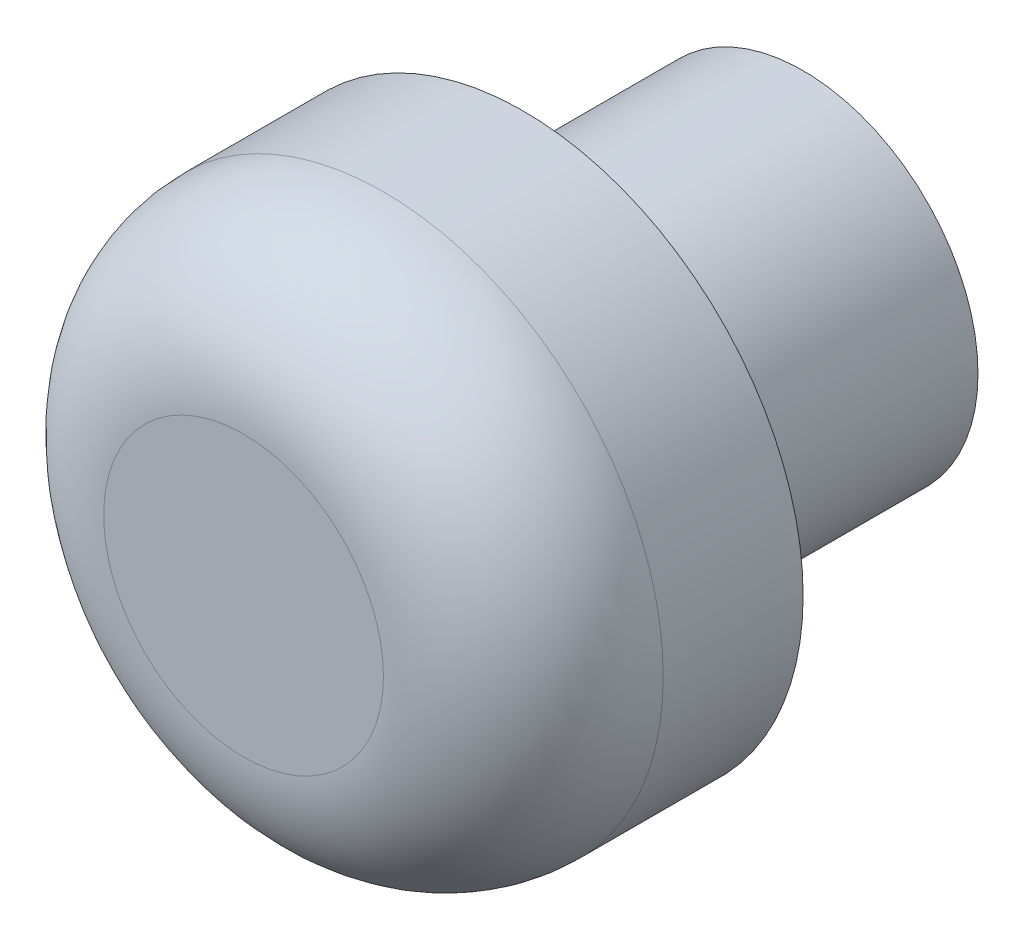
ISO-10303-21;
HEADER;
FILE_DESCRIPTION(('STEP AP214'),'2;1');
FILE_NAME('part.step','',(''),(''),'','','');
FILE_SCHEMA(('AUTOMOTIVE_DESIGN { 1 0 10303 214 1 1 1 1 }'));
ENDSEC;
DATA;
#1=APPLICATION_CONTEXT('core data for automotive mechanical design processes');
#2=APPLICATION_PROTOCOL_DEFINITION('international standard','automotive_design',2000,#1);
#3=PRODUCT_CONTEXT('',#1,'mechanical');
#4=PRODUCT('Part','Part','',(#3));
#5=PRODUCT_RELATED_PRODUCT_CATEGORY('part','',(#4));
#6=PRODUCT_DEFINITION_FORMATION('','',#4);
#7=PRODUCT_DEFINITION_CONTEXT('part definition',#1,'design');
#8=PRODUCT_DEFINITION('design','',#6,#7);
#9=PRODUCT_DEFINITION_SHAPE('','',#8);
#10=(LENGTH_UNIT() NAMED_UNIT(*) SI_UNIT(.MILLI.,.METRE.));
#11=(NAMED_UNIT(*) PLANE_ANGLE_UNIT() SI_UNIT($,.RADIAN.));
#12=(NAMED_UNIT(*) SI_UNIT($,.STERADIAN.) SOLID_ANGLE_UNIT());
#13=UNCERTAINTY_MEASURE_WITH_UNIT(LENGTH_MEASURE(1.E-05),#10,'distance_accuracy_value','');
#14=(GEOMETRIC_REPRESENTATION_CONTEXT(3) GLOBAL_UNCERTAINTY_ASSIGNED_CONTEXT((#13)) GLOBAL_UNIT_ASSIGNED_CONTEXT((#10,
#11,#12)) REPRESENTATION_CONTEXT('',''));
#15=CARTESIAN_POINT('',(0.,0.,0.));
#16=DIRECTION('',(0.,0.,1.));
#17=DIRECTION('',(1.,0.,0.));
#18=AXIS2_PLACEMENT_3D('',#15,#16,#17);
#19=CARTESIAN_POINT('',(0.,0.,0.));
#20=DIRECTION('',(0.,0.,1.));
#21=DIRECTION('',(1.,0.,0.));
#22=AXIS2_PLACEMENT_3D('',#19,#20,#21);
#23=PLANE('',#22);
#24=CARTESIAN_POINT('',(0.,0.,0.));
#25=DIRECTION('',(0.,0.,1.));
#26=DIRECTION('',(1.,0.,0.));
#27=AXIS2_PLACEMENT_3D('',#24,#25,#26);
#28=CIRCLE('',#27,20.);
#29=CARTESIAN_POINT('',(20.,0.,0.));
#30=VERTEX_POINT('',#29);
#31=EDGE_CURVE('E49',#30,#30,#28,.T.);
#32=ORIENTED_EDGE('',*,*,#31,.F.);
#33=EDGE_LOOP('',(#32));
#34=FACE_BOUND('',#33,.T.);
#35=CARTESIAN_POINT('',(0.,0.,0.));
#36=DIRECTION('',(0.,0.,1.));
#37=DIRECTION('',(1.,0.,0.));
#38=AXIS2_PLACEMENT_3D('',#35,#36,#37);
#39=CIRCLE('',#38,12.5);
#40=CARTESIAN_POINT('',(12.5,0.,0.));
#41=VERTEX_POINT('',#40);
#42=EDGE_CURVE('E10',#41,#41,#39,.F.);
#43=ORIENTED_EDGE('',*,*,#42,.F.);
#44=EDGE_LOOP('',(#43));
#45=FACE_BOUND('',#44,.T.);
#46=ADVANCED_FACE('F34',(#34,#45),#23,.F.);
#47=CARTESIAN_POINT('',(0.,0.,20.));
#48=DIRECTION('',(0.,0.,-1.));
#49=DIRECTION('',(-1.,0.,0.));
#50=AXIS2_PLACEMENT_3D('',#47,#48,#49);
#51=CYLINDRICAL_SURFACE('',#50,20.);
#52=CARTESIAN_POINT('',(0.,0.,10.));
#53=DIRECTION('',(0.,0.,1.));
#54=DIRECTION('',(1.,0.,0.));
#55=AXIS2_PLACEMENT_3D('',#52,#53,#54);
#56=CIRCLE('',#55,20.);
#57=CARTESIAN_POINT('',(20.,0.,10.));
#58=VERTEX_POINT('',#57);
#59=EDGE_CURVE('E41',#58,#58,#56,.F.);
#60=ORIENTED_EDGE('',*,*,#59,.T.);
#61=EDGE_LOOP('',(#60));
#62=FACE_BOUND('',#61,.T.);
#63=ORIENTED_EDGE('',*,*,#31,.T.);
#64=EDGE_LOOP('',(#63));
#65=FACE_BOUND('',#64,.T.);
#66=ADVANCED_FACE('F88',(#62,#65),#51,.T.);
#67=CARTESIAN_POINT('',(0.,0.,20.));
#68=DIRECTION('',(0.,0.,1.));
#69=DIRECTION('',(1.,0.,0.));
#70=AXIS2_PLACEMENT_3D('',#67,#68,#69);
#71=PLANE('',#70);
#72=CARTESIAN_POINT('',(0.,0.,20.));
#73=DIRECTION('',(0.,0.,1.));
#74=DIRECTION('',(1.,0.,0.));
#75=AXIS2_PLACEMENT_3D('',#72,#73,#74);
#76=CIRCLE('',#75,10.);
#77=CARTESIAN_POINT('',(10.,0.,20.));
#78=VERTEX_POINT('',#77);
#79=EDGE_CURVE('E45',#78,#78,#76,.T.);
#80=ORIENTED_EDGE('',*,*,#79,.T.);
#81=EDGE_LOOP('',(#80));
#82=FACE_BOUND('',#81,.T.);
#83=ADVANCED_FACE('F84',(#82),#71,.T.);
#84=CARTESIAN_POINT('',(0.,0.,10.));
#85=DIRECTION('',(0.,0.,1.));
#86=DIRECTION('',(1.,0.,0.));
#87=AXIS2_PLACEMENT_3D('',#84,#85,#86);
#88=DEGENERATE_TOROIDAL_SURFACE('',#87,10.,10.,.T.);
#89=ORIENTED_EDGE('',*,*,#59,.F.);
#90=EDGE_LOOP('',(#89));
#91=FACE_BOUND('',#90,.T.);
#92=ORIENTED_EDGE('',*,*,#79,.F.);
#93=EDGE_LOOP('',(#92));
#94=FACE_BOUND('',#93,.T.);
#95=ADVANCED_FACE('F36',(#91,#94),#88,.T.);
#96=CARTESIAN_POINT('',(0.,0.,-20.));
#97=DIRECTION('',(0.,0.,1.));
#98=DIRECTION('',(1.,0.,0.));
#99=AXIS2_PLACEMENT_3D('',#96,#97,#98);
#100=CYLINDRICAL_SURFACE('',#99,12.5);
#101=CARTESIAN_POINT('',(0.,0.,-20.));
#102=DIRECTION('',(0.,0.,-1.));
#103=DIRECTION('',(-1.,0.,0.));
#104=AXIS2_PLACEMENT_3D('',#101,#102,#103);
#105=CIRCLE('',#104,12.5);
#106=CARTESIAN_POINT('',(-12.5,0.,-20.));
#107=VERTEX_POINT('',#106);
#108=EDGE_CURVE('E54',#107,#107,#105,.T.);
#109=ORIENTED_EDGE('',*,*,#108,.F.);
#110=EDGE_LOOP('',(#109));
#111=FACE_BOUND('',#110,.T.);
#112=ORIENTED_EDGE('',*,*,#42,.T.);
#113=EDGE_LOOP('',(#112));
#114=FACE_BOUND('',#113,.T.);
#115=ADVANCED_FACE('F75',(#111,#114),#100,.T.);
#116=CARTESIAN_POINT('',(0.,0.,-20.));
#117=DIRECTION('',(0.,0.,-1.));
#118=DIRECTION('',(-1.,0.,0.));
#119=AXIS2_PLACEMENT_3D('',#116,#117,#118);
#120=PLANE('',#119);
#121=CARTESIAN_POINT('',(0.,0.,-20.));
#122=DIRECTION('',(0.,0.,-1.));
#123=DIRECTION('',(-1.,0.,0.));
#124=AXIS2_PLACEMENT_3D('',#121,#122,#123);
#125=CIRCLE('',#124,3.);
#126=CARTESIAN_POINT('',(-3.,0.,-20.));
#127=VERTEX_POINT('',#126);
#128=EDGE_CURVE('E58',#127,#127,#125,.T.);
#129=ORIENTED_EDGE('',*,*,#128,.F.);
#130=EDGE_LOOP('',(#129));
#131=FACE_BOUND('',#130,.T.);
#132=ORIENTED_EDGE('',*,*,#108,.T.);
#133=EDGE_LOOP('',(#132));
#134=FACE_BOUND('',#133,.T.);
#135=ADVANCED_FACE('F69',(#131,#134),#120,.T.);
#136=CARTESIAN_POINT('',(0.,0.,10.));
#137=DIRECTION('',(0.,0.,-1.));
#138=DIRECTION('',(-1.,0.,0.));
#139=AXIS2_PLACEMENT_3D('',#136,#137,#138);
#140=CYLINDRICAL_SURFACE('',#139,3.);
#141=CARTESIAN_POINT('',(0.,0.,10.));
#142=DIRECTION('',(0.,0.,-1.));
#143=DIRECTION('',(-1.,0.,0.));
#144=AXIS2_PLACEMENT_3D('',#141,#142,#143);
#145=CIRCLE('',#144,3.);
#146=CARTESIAN_POINT('',(-3.,0.,10.));
#147=VERTEX_POINT('',#146);
#148=EDGE_CURVE('E57',#147,#147,#145,.T.);
#149=ORIENTED_EDGE('',*,*,#148,.F.);
#150=EDGE_LOOP('',(#149));
#151=FACE_BOUND('',#150,.T.);
#152=ORIENTED_EDGE('',*,*,#128,.T.);
#153=EDGE_LOOP('',(#152));
#154=FACE_BOUND('',#153,.T.);
#155=ADVANCED_FACE('F66',(#151,#154),#140,.F.);
#156=CARTESIAN_POINT('',(0.,0.,10.));
#157=DIRECTION('',(0.,0.,-1.));
#158=DIRECTION('',(-1.,0.,0.));
#159=AXIS2_PLACEMENT_3D('',#156,#157,#158);
#160=PLANE('',#159);
#161=ORIENTED_EDGE('',*,*,#148,.T.);
#162=EDGE_LOOP('',(#161));
#163=FACE_BOUND('',#162,.T.);
#164=ADVANCED_FACE('F64',(#163),#160,.T.);
#165=CLOSED_SHELL('',(#46,#66,#83,#95,#115,#135,#155,#164));
#166=MANIFOLD_SOLID_BREP('B2',#165);
#167=ADVANCED_BREP_SHAPE_REPRESENTATION('',(#18,#166),#14);
#168=SHAPE_DEFINITION_REPRESENTATION(#9,#167);
ENDSEC;
END-ISO-10303-21;
